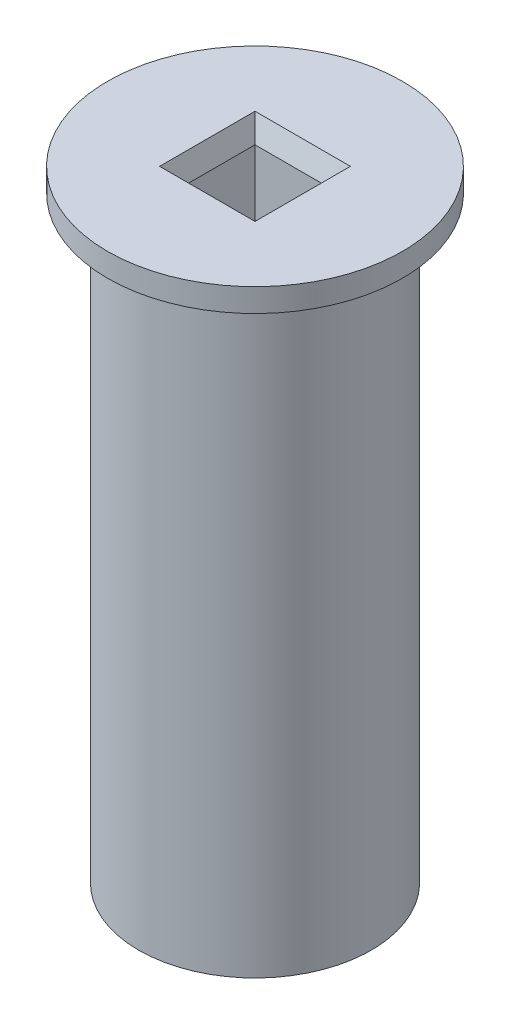
ISO-10303-21;
HEADER;
FILE_DESCRIPTION(('STEP AP214'),'2;1');
FILE_NAME('part.step','',(''),(''),'','','');
FILE_SCHEMA(('AUTOMOTIVE_DESIGN { 1 0 10303 214 1 1 1 1 }'));
ENDSEC;
DATA;
#1=APPLICATION_CONTEXT('core data for automotive mechanical design processes');
#2=APPLICATION_PROTOCOL_DEFINITION('international standard','automotive_design',2000,#1);
#3=PRODUCT_CONTEXT('',#1,'mechanical');
#4=PRODUCT('Part','Part','',(#3));
#5=PRODUCT_RELATED_PRODUCT_CATEGORY('part','',(#4));
#6=PRODUCT_DEFINITION_FORMATION('','',#4);
#7=PRODUCT_DEFINITION_CONTEXT('part definition',#1,'design');
#8=PRODUCT_DEFINITION('design','',#6,#7);
#9=PRODUCT_DEFINITION_SHAPE('','',#8);
#10=(LENGTH_UNIT() NAMED_UNIT(*) SI_UNIT(.MILLI.,.METRE.));
#11=(NAMED_UNIT(*) PLANE_ANGLE_UNIT() SI_UNIT($,.RADIAN.));
#12=(NAMED_UNIT(*) SI_UNIT($,.STERADIAN.) SOLID_ANGLE_UNIT());
#13=UNCERTAINTY_MEASURE_WITH_UNIT(LENGTH_MEASURE(1.E-05),#10,'distance_accuracy_value','');
#14=(GEOMETRIC_REPRESENTATION_CONTEXT(3) GLOBAL_UNCERTAINTY_ASSIGNED_CONTEXT((#13)) GLOBAL_UNIT_ASSIGNED_CONTEXT((#10,
#11,#12)) REPRESENTATION_CONTEXT('',''));
#15=CARTESIAN_POINT('',(0.,0.,0.));
#16=DIRECTION('',(0.,0.,1.));
#17=DIRECTION('',(1.,0.,0.));
#18=AXIS2_PLACEMENT_3D('',#15,#16,#17);
#19=CARTESIAN_POINT('',(0.,80.,0.));
#20=DIRECTION('',(0.,-1.,0.));
#21=DIRECTION('',(0.,0.,-1.));
#22=AXIS2_PLACEMENT_3D('',#19,#20,#21);
#23=CYLINDRICAL_SURFACE('',#22,15.);
#24=CARTESIAN_POINT('',(0.,0.,0.));
#25=DIRECTION('',(0.,1.,0.));
#26=DIRECTION('',(0.,0.,1.));
#27=AXIS2_PLACEMENT_3D('',#24,#25,#26);
#28=CIRCLE('',#27,15.);
#29=CARTESIAN_POINT('',(0.,0.,15.));
#30=VERTEX_POINT('',#29);
#31=EDGE_CURVE('E97',#30,#30,#28,.T.);
#32=ORIENTED_EDGE('',*,*,#31,.T.);
#33=EDGE_LOOP('',(#32));
#34=FACE_BOUND('',#33,.T.);
#35=CARTESIAN_POINT('',(0.,77.,0.));
#36=DIRECTION('',(0.,1.,0.));
#37=DIRECTION('',(0.,0.,1.));
#38=AXIS2_PLACEMENT_3D('',#35,#36,#37);
#39=CIRCLE('',#38,15.);
#40=CARTESIAN_POINT('',(0.,77.,15.));
#41=VERTEX_POINT('',#40);
#42=EDGE_CURVE('E118',#41,#41,#39,.T.);
#43=ORIENTED_EDGE('',*,*,#42,.F.);
#44=EDGE_LOOP('',(#43));
#45=FACE_BOUND('',#44,.T.);
#46=ADVANCED_FACE('F38',(#34,#45),#23,.T.);
#47=CARTESIAN_POINT('',(0.,80.,0.));
#48=DIRECTION('',(0.,1.,0.));
#49=DIRECTION('',(0.,0.,1.));
#50=AXIS2_PLACEMENT_3D('',#47,#48,#49);
#51=PLANE('',#50);
#52=DIRECTION('',(1.,0.,0.));
#53=VECTOR('',#52,1.);
#54=CARTESIAN_POINT('',(0.,80.,-6.14999999999999));
#55=LINE('',#54,#53);
#56=CARTESIAN_POINT('',(-6.14999999999999,80.,-6.14999999999999));
#57=VERTEX_POINT('',#56);
#58=CARTESIAN_POINT('',(6.15,80.,-6.14999999999999));
#59=VERTEX_POINT('',#58);
#60=EDGE_CURVE('E133',#57,#59,#55,.T.);
#61=ORIENTED_EDGE('',*,*,#60,.T.);
#62=DIRECTION('',(0.,0.,1.));
#63=VECTOR('',#62,1.);
#64=CARTESIAN_POINT('',(6.15,80.,0.));
#65=LINE('',#64,#63);
#66=CARTESIAN_POINT('',(6.15,80.,6.15));
#67=VERTEX_POINT('',#66);
#68=EDGE_CURVE('E139',#59,#67,#65,.T.);
#69=ORIENTED_EDGE('',*,*,#68,.T.);
#70=DIRECTION('',(-1.,0.,0.));
#71=VECTOR('',#70,1.);
#72=CARTESIAN_POINT('',(0.,80.,6.15));
#73=LINE('',#72,#71);
#74=CARTESIAN_POINT('',(-6.14999999999999,80.,6.15));
#75=VERTEX_POINT('',#74);
#76=EDGE_CURVE('E137',#67,#75,#73,.T.);
#77=ORIENTED_EDGE('',*,*,#76,.T.);
#78=DIRECTION('',(0.,0.,-1.));
#79=VECTOR('',#78,1.);
#80=CARTESIAN_POINT('',(-6.14999999999999,80.,0.));
#81=LINE('',#80,#79);
#82=EDGE_CURVE('E135',#75,#57,#81,.T.);
#83=ORIENTED_EDGE('',*,*,#82,.T.);
#84=EDGE_LOOP('',(#61,#69,#77,#83));
#85=FACE_BOUND('',#84,.T.);
#86=CARTESIAN_POINT('',(0.,80.,0.));
#87=DIRECTION('',(0.,1.,0.));
#88=DIRECTION('',(0.,0.,1.));
#89=AXIS2_PLACEMENT_3D('',#86,#87,#88);
#90=CIRCLE('',#89,19.);
#91=CARTESIAN_POINT('',(0.,80.,19.));
#92=VERTEX_POINT('',#91);
#93=EDGE_CURVE('E115',#92,#92,#90,.T.);
#94=ORIENTED_EDGE('',*,*,#93,.T.);
#95=EDGE_LOOP('',(#94));
#96=FACE_BOUND('',#95,.T.);
#97=ADVANCED_FACE('F160',(#85,#96),#51,.T.);
#98=CARTESIAN_POINT('',(0.,0.,0.));
#99=DIRECTION('',(0.,1.,0.));
#100=DIRECTION('',(0.,0.,1.));
#101=AXIS2_PLACEMENT_3D('',#98,#99,#100);
#102=PLANE('',#101);
#103=ORIENTED_EDGE('',*,*,#31,.F.);
#104=EDGE_LOOP('',(#103));
#105=FACE_BOUND('',#104,.T.);
#106=DIRECTION('',(0.,0.,1.));
#107=VECTOR('',#106,1.);
#108=CARTESIAN_POINT('',(-5.15,0.,5.15));
#109=LINE('',#108,#107);
#110=CARTESIAN_POINT('',(-5.15,0.,-5.15));
#111=VERTEX_POINT('',#110);
#112=CARTESIAN_POINT('',(-5.15,0.,5.15));
#113=VERTEX_POINT('',#112);
#114=EDGE_CURVE('E93',#111,#113,#109,.T.);
#115=ORIENTED_EDGE('',*,*,#114,.T.);
#116=DIRECTION('',(1.,0.,0.));
#117=VECTOR('',#116,1.);
#118=CARTESIAN_POINT('',(5.15,0.,5.15));
#119=LINE('',#118,#117);
#120=CARTESIAN_POINT('',(5.15,0.,5.15));
#121=VERTEX_POINT('',#120);
#122=EDGE_CURVE('E101',#113,#121,#119,.T.);
#123=ORIENTED_EDGE('',*,*,#122,.T.);
#124=DIRECTION('',(0.,0.,-1.));
#125=VECTOR('',#124,1.);
#126=CARTESIAN_POINT('',(5.15,0.,5.15));
#127=LINE('',#126,#125);
#128=CARTESIAN_POINT('',(5.15,0.,-5.15));
#129=VERTEX_POINT('',#128);
#130=EDGE_CURVE('E107',#121,#129,#127,.T.);
#131=ORIENTED_EDGE('',*,*,#130,.T.);
#132=DIRECTION('',(-1.,0.,0.));
#133=VECTOR('',#132,1.);
#134=CARTESIAN_POINT('',(5.15,0.,-5.15));
#135=LINE('',#134,#133);
#136=EDGE_CURVE('E111',#129,#111,#135,.T.);
#137=ORIENTED_EDGE('',*,*,#136,.T.);
#138=EDGE_LOOP('',(#115,#123,#131,#137));
#139=FACE_BOUND('',#138,.T.);
#140=ADVANCED_FACE('F109',(#105,#139),#102,.F.);
#141=CARTESIAN_POINT('',(-5.15,80.,5.15));
#142=DIRECTION('',(1.,0.,0.));
#143=DIRECTION('',(0.,0.,-1.));
#144=AXIS2_PLACEMENT_3D('',#141,#142,#143);
#145=PLANE('',#144);
#146=DIRECTION('',(0.,-1.,0.));
#147=VECTOR('',#146,1.);
#148=CARTESIAN_POINT('',(-5.15,80.,-5.15));
#149=LINE('',#148,#147);
#150=CARTESIAN_POINT('',(-5.15,77.2525225805454,-5.15));
#151=VERTEX_POINT('',#150);
#152=EDGE_CURVE('E123',#151,#111,#149,.T.);
#153=ORIENTED_EDGE('',*,*,#152,.F.);
#154=DIRECTION('',(0.,0.,1.));
#155=VECTOR('',#154,1.);
#156=CARTESIAN_POINT('',(-5.15,77.2525225805454,5.15));
#157=LINE('',#156,#155);
#158=CARTESIAN_POINT('',(-5.15,77.2525225805454,5.15));
#159=VERTEX_POINT('',#158);
#160=EDGE_CURVE('E47',#151,#159,#157,.T.);
#161=ORIENTED_EDGE('',*,*,#160,.T.);
#162=DIRECTION('',(0.,-1.,0.));
#163=VECTOR('',#162,1.);
#164=CARTESIAN_POINT('',(-5.15,80.,5.15));
#165=LINE('',#164,#163);
#166=EDGE_CURVE('E89',#159,#113,#165,.T.);
#167=ORIENTED_EDGE('',*,*,#166,.T.);
#168=ORIENTED_EDGE('',*,*,#114,.F.);
#169=EDGE_LOOP('',(#153,#161,#167,#168));
#170=FACE_BOUND('',#169,.T.);
#171=ADVANCED_FACE('F91',(#170),#145,.T.);
#172=CARTESIAN_POINT('',(5.15,80.,5.15));
#173=DIRECTION('',(0.,0.,-1.));
#174=DIRECTION('',(-1.,0.,0.));
#175=AXIS2_PLACEMENT_3D('',#172,#173,#174);
#176=PLANE('',#175);
#177=ORIENTED_EDGE('',*,*,#166,.F.);
#178=DIRECTION('',(1.,0.,0.));
#179=VECTOR('',#178,1.);
#180=CARTESIAN_POINT('',(5.15,77.2525225805454,5.15));
#181=LINE('',#180,#179);
#182=CARTESIAN_POINT('',(5.15,77.2525225805454,5.15));
#183=VERTEX_POINT('',#182);
#184=EDGE_CURVE('E142',#159,#183,#181,.T.);
#185=ORIENTED_EDGE('',*,*,#184,.T.);
#186=DIRECTION('',(0.,-1.,0.));
#187=VECTOR('',#186,1.);
#188=CARTESIAN_POINT('',(5.15,80.,5.15));
#189=LINE('',#188,#187);
#190=EDGE_CURVE('E98',#183,#121,#189,.T.);
#191=ORIENTED_EDGE('',*,*,#190,.T.);
#192=ORIENTED_EDGE('',*,*,#122,.F.);
#193=EDGE_LOOP('',(#177,#185,#191,#192));
#194=FACE_BOUND('',#193,.T.);
#195=ADVANCED_FACE('F102',(#194),#176,.T.);
#196=CARTESIAN_POINT('',(5.15,80.,5.15));
#197=DIRECTION('',(-1.,0.,0.));
#198=DIRECTION('',(0.,0.,1.));
#199=AXIS2_PLACEMENT_3D('',#196,#197,#198);
#200=PLANE('',#199);
#201=ORIENTED_EDGE('',*,*,#190,.F.);
#202=DIRECTION('',(0.,0.,-1.));
#203=VECTOR('',#202,1.);
#204=CARTESIAN_POINT('',(5.15,77.2525225805454,5.15));
#205=LINE('',#204,#203);
#206=CARTESIAN_POINT('',(5.15,77.2525225805454,-5.15));
#207=VERTEX_POINT('',#206);
#208=EDGE_CURVE('E130',#183,#207,#205,.T.);
#209=ORIENTED_EDGE('',*,*,#208,.T.);
#210=DIRECTION('',(0.,-1.,0.));
#211=VECTOR('',#210,1.);
#212=CARTESIAN_POINT('',(5.15,80.,-5.15));
#213=LINE('',#212,#211);
#214=EDGE_CURVE('E125',#207,#129,#213,.T.);
#215=ORIENTED_EDGE('',*,*,#214,.T.);
#216=ORIENTED_EDGE('',*,*,#130,.F.);
#217=EDGE_LOOP('',(#201,#209,#215,#216));
#218=FACE_BOUND('',#217,.T.);
#219=ADVANCED_FACE('F250',(#218),#200,.T.);
#220=CARTESIAN_POINT('',(5.15,80.,-5.15));
#221=DIRECTION('',(0.,0.,1.));
#222=DIRECTION('',(1.,0.,0.));
#223=AXIS2_PLACEMENT_3D('',#220,#221,#222);
#224=PLANE('',#223);
#225=ORIENTED_EDGE('',*,*,#214,.F.);
#226=DIRECTION('',(-1.,0.,0.));
#227=VECTOR('',#226,1.);
#228=CARTESIAN_POINT('',(5.15,77.2525225805454,-5.15));
#229=LINE('',#228,#227);
#230=EDGE_CURVE('E11',#207,#151,#229,.T.);
#231=ORIENTED_EDGE('',*,*,#230,.T.);
#232=ORIENTED_EDGE('',*,*,#152,.T.);
#233=ORIENTED_EDGE('',*,*,#136,.F.);
#234=EDGE_LOOP('',(#225,#231,#232,#233));
#235=FACE_BOUND('',#234,.T.);
#236=ADVANCED_FACE('F173',(#235),#224,.T.);
#237=CARTESIAN_POINT('',(0.,77.,0.));
#238=DIRECTION('',(0.,1.,0.));
#239=DIRECTION('',(0.,0.,1.));
#240=AXIS2_PLACEMENT_3D('',#237,#238,#239);
#241=PLANE('',#240);
#242=CARTESIAN_POINT('',(0.,77.,0.));
#243=DIRECTION('',(0.,1.,0.));
#244=DIRECTION('',(0.,0.,1.));
#245=AXIS2_PLACEMENT_3D('',#242,#243,#244);
#246=CIRCLE('',#245,19.);
#247=CARTESIAN_POINT('',(0.,77.,19.));
#248=VERTEX_POINT('',#247);
#249=EDGE_CURVE('E112',#248,#248,#246,.T.);
#250=ORIENTED_EDGE('',*,*,#249,.F.);
#251=EDGE_LOOP('',(#250));
#252=FACE_BOUND('',#251,.T.);
#253=ORIENTED_EDGE('',*,*,#42,.T.);
#254=EDGE_LOOP('',(#253));
#255=FACE_BOUND('',#254,.T.);
#256=ADVANCED_FACE('F164',(#252,#255),#241,.F.);
#257=CARTESIAN_POINT('',(0.,77.,0.));
#258=DIRECTION('',(0.,1.,0.));
#259=DIRECTION('',(0.,0.,1.));
#260=AXIS2_PLACEMENT_3D('',#257,#258,#259);
#261=CYLINDRICAL_SURFACE('',#260,19.);
#262=ORIENTED_EDGE('',*,*,#249,.T.);
#263=EDGE_LOOP('',(#262));
#264=FACE_BOUND('',#263,.T.);
#265=ORIENTED_EDGE('',*,*,#93,.F.);
#266=EDGE_LOOP('',(#265));
#267=FACE_BOUND('',#266,.T.);
#268=ADVANCED_FACE('F162',(#264,#267),#261,.T.);
#269=CARTESIAN_POINT('',(-5.15,77.2525225805454,5.15));
#270=DIRECTION('',(-0.939692620785909,-0.342020143325667,0.));
#271=DIRECTION('',(0.,0.,1.));
#272=AXIS2_PLACEMENT_3D('',#269,#270,#271);
#273=PLANE('',#272);
#274=DIRECTION('',(0.323615577118183,-0.889126490715989,0.323615577118183));
#275=VECTOR('',#274,1.);
#276=CARTESIAN_POINT('',(-4.07131146993859,74.2888502015769,-4.07131146993859));
#277=LINE('',#276,#275);
#278=EDGE_CURVE('E148',#57,#151,#277,.T.);
#279=ORIENTED_EDGE('',*,*,#278,.F.);
#280=ORIENTED_EDGE('',*,*,#82,.F.);
#281=DIRECTION('',(0.323615577118183,-0.889126490715989,-0.323615577118183));
#282=VECTOR('',#281,1.);
#283=CARTESIAN_POINT('',(-4.07131146993859,74.2888502015769,4.07131146993859));
#284=LINE('',#283,#282);
#285=EDGE_CURVE('E42',#159,#75,#284,.F.);
#286=ORIENTED_EDGE('',*,*,#285,.F.);
#287=ORIENTED_EDGE('',*,*,#160,.F.);
#288=EDGE_LOOP('',(#279,#280,#286,#287));
#289=FACE_BOUND('',#288,.T.);
#290=ADVANCED_FACE('F40',(#289),#273,.F.);
#291=CARTESIAN_POINT('',(5.15,77.2525225805454,5.15));
#292=DIRECTION('',(0.,-0.342020143325667,0.939692620785909));
#293=DIRECTION('',(1.,0.,0.));
#294=AXIS2_PLACEMENT_3D('',#291,#292,#293);
#295=PLANE('',#294);
#296=ORIENTED_EDGE('',*,*,#285,.T.);
#297=ORIENTED_EDGE('',*,*,#76,.F.);
#298=DIRECTION('',(-0.323615577118183,-0.889126490715989,-0.323615577118183));
#299=VECTOR('',#298,1.);
#300=CARTESIAN_POINT('',(5.15,77.2525225805454,5.15));
#301=LINE('',#300,#299);
#302=EDGE_CURVE('E147',#183,#67,#301,.F.);
#303=ORIENTED_EDGE('',*,*,#302,.F.);
#304=ORIENTED_EDGE('',*,*,#184,.F.);
#305=EDGE_LOOP('',(#296,#297,#303,#304));
#306=FACE_BOUND('',#305,.T.);
#307=ADVANCED_FACE('F171',(#306),#295,.F.);
#308=CARTESIAN_POINT('',(5.15,77.2525225805454,-5.15));
#309=DIRECTION('',(0.,-0.342020143325667,-0.939692620785909));
#310=DIRECTION('',(-1.,0.,0.));
#311=AXIS2_PLACEMENT_3D('',#308,#309,#310);
#312=PLANE('',#311);
#313=ORIENTED_EDGE('',*,*,#278,.T.);
#314=ORIENTED_EDGE('',*,*,#230,.F.);
#315=DIRECTION('',(0.323615577118183,0.889126490715989,-0.323615577118183));
#316=VECTOR('',#315,1.);
#317=CARTESIAN_POINT('',(4.07131146993859,74.2888502015769,-4.07131146993859));
#318=LINE('',#317,#316);
#319=EDGE_CURVE('E145',#59,#207,#318,.F.);
#320=ORIENTED_EDGE('',*,*,#319,.F.);
#321=ORIENTED_EDGE('',*,*,#60,.F.);
#322=EDGE_LOOP('',(#313,#314,#320,#321));
#323=FACE_BOUND('',#322,.T.);
#324=ADVANCED_FACE('F191',(#323),#312,.F.);
#325=CARTESIAN_POINT('',(5.15,77.2525225805454,5.15));
#326=DIRECTION('',(0.939692620785909,-0.342020143325667,0.));
#327=DIRECTION('',(0.,0.,-1.));
#328=AXIS2_PLACEMENT_3D('',#325,#326,#327);
#329=PLANE('',#328);
#330=ORIENTED_EDGE('',*,*,#302,.T.);
#331=ORIENTED_EDGE('',*,*,#68,.F.);
#332=ORIENTED_EDGE('',*,*,#319,.T.);
#333=ORIENTED_EDGE('',*,*,#208,.F.);
#334=EDGE_LOOP('',(#330,#331,#332,#333));
#335=FACE_BOUND('',#334,.T.);
#336=ADVANCED_FACE('F188',(#335),#329,.F.);
#337=CLOSED_SHELL('',(#46,#97,#140,#171,#195,#219,#236,#256,#268,#290,#307,#324,#336));
#338=MANIFOLD_SOLID_BREP('B2',#337);
#339=ADVANCED_BREP_SHAPE_REPRESENTATION('',(#18,#338),#14);
#340=SHAPE_DEFINITION_REPRESENTATION(#9,#339);
ENDSEC;
END-ISO-10303-21;
